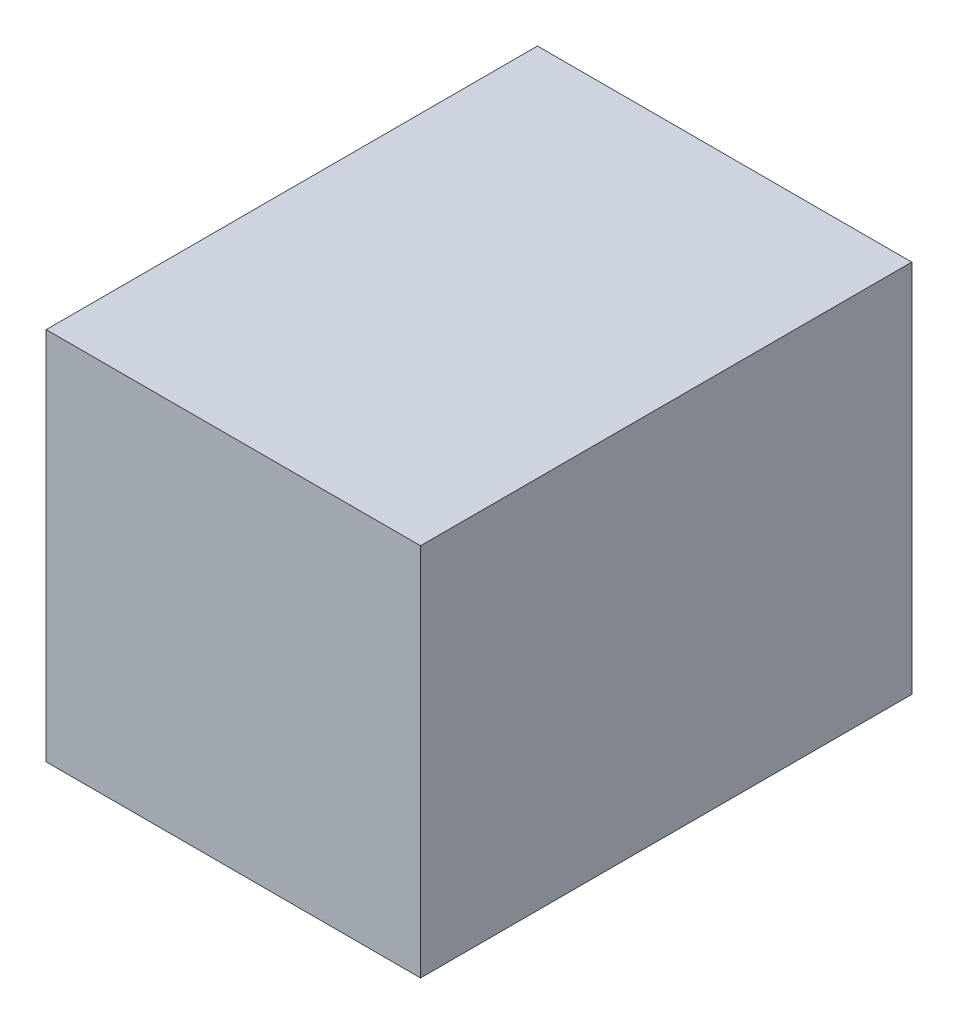
ISO-10303-21;
HEADER;
FILE_DESCRIPTION(('STEP AP214'),'2;1');
FILE_NAME('part.step','',(''),(''),'','','');
FILE_SCHEMA(('AUTOMOTIVE_DESIGN { 1 0 10303 214 1 1 1 1 }'));
ENDSEC;
DATA;
#1=APPLICATION_CONTEXT('core data for automotive mechanical design processes');
#2=APPLICATION_PROTOCOL_DEFINITION('international standard','automotive_design',2000,#1);
#3=PRODUCT_CONTEXT('',#1,'mechanical');
#4=PRODUCT('Part','Part','',(#3));
#5=PRODUCT_RELATED_PRODUCT_CATEGORY('part','',(#4));
#6=PRODUCT_DEFINITION_FORMATION('','',#4);
#7=PRODUCT_DEFINITION_CONTEXT('part definition',#1,'design');
#8=PRODUCT_DEFINITION('design','',#6,#7);
#9=PRODUCT_DEFINITION_SHAPE('','',#8);
#10=(LENGTH_UNIT() NAMED_UNIT(*) SI_UNIT(.MILLI.,.METRE.));
#11=(NAMED_UNIT(*) PLANE_ANGLE_UNIT() SI_UNIT($,.RADIAN.));
#12=(NAMED_UNIT(*) SI_UNIT($,.STERADIAN.) SOLID_ANGLE_UNIT());
#13=UNCERTAINTY_MEASURE_WITH_UNIT(LENGTH_MEASURE(1.E-05),#10,'distance_accuracy_value','');
#14=(GEOMETRIC_REPRESENTATION_CONTEXT(3) GLOBAL_UNCERTAINTY_ASSIGNED_CONTEXT((#13)) GLOBAL_UNIT_ASSIGNED_CONTEXT((#10,
#11,#12)) REPRESENTATION_CONTEXT('',''));
#15=CARTESIAN_POINT('',(0.,0.,0.));
#16=DIRECTION('',(0.,0.,1.));
#17=DIRECTION('',(1.,0.,0.));
#18=AXIS2_PLACEMENT_3D('',#15,#16,#17);
#19=CARTESIAN_POINT('',(381.,-381.,1000.));
#20=DIRECTION('',(-1.,0.,0.));
#21=DIRECTION('',(0.,0.,1.));
#22=AXIS2_PLACEMENT_3D('',#19,#20,#21);
#23=PLANE('',#22);
#24=DIRECTION('',(0.,1.,0.));
#25=VECTOR('',#24,1.);
#26=CARTESIAN_POINT('',(381.,-381.,0.));
#27=LINE('',#26,#25);
#28=CARTESIAN_POINT('',(381.,-381.,0.));
#29=VERTEX_POINT('',#28);
#30=CARTESIAN_POINT('',(381.,381.,0.));
#31=VERTEX_POINT('',#30);
#32=EDGE_CURVE('E96',#29,#31,#27,.T.);
#33=ORIENTED_EDGE('',*,*,#32,.T.);
#34=DIRECTION('',(0.,0.,-1.));
#35=VECTOR('',#34,1.);
#36=CARTESIAN_POINT('',(381.,381.,1000.));
#37=LINE('',#36,#35);
#38=CARTESIAN_POINT('',(381.,381.,1000.));
#39=VERTEX_POINT('',#38);
#40=EDGE_CURVE('E11',#39,#31,#37,.T.);
#41=ORIENTED_EDGE('',*,*,#40,.F.);
#42=DIRECTION('',(0.,1.,0.));
#43=VECTOR('',#42,1.);
#44=CARTESIAN_POINT('',(381.,-381.,1000.));
#45=LINE('',#44,#43);
#46=CARTESIAN_POINT('',(381.,-381.,1000.));
#47=VERTEX_POINT('',#46);
#48=EDGE_CURVE('E84',#47,#39,#45,.T.);
#49=ORIENTED_EDGE('',*,*,#48,.F.);
#50=DIRECTION('',(0.,0.,-1.));
#51=VECTOR('',#50,1.);
#52=CARTESIAN_POINT('',(381.,-381.,1000.));
#53=LINE('',#52,#51);
#54=EDGE_CURVE('E92',#47,#29,#53,.T.);
#55=ORIENTED_EDGE('',*,*,#54,.T.);
#56=EDGE_LOOP('',(#33,#41,#49,#55));
#57=FACE_BOUND('',#56,.T.);
#58=ADVANCED_FACE('F33',(#57),#23,.F.);
#59=CARTESIAN_POINT('',(-381.,381.,1000.));
#60=DIRECTION('',(0.,-1.,0.));
#61=DIRECTION('',(0.,0.,-1.));
#62=AXIS2_PLACEMENT_3D('',#59,#60,#61);
#63=PLANE('',#62);
#64=DIRECTION('',(-1.,0.,0.));
#65=VECTOR('',#64,1.);
#66=CARTESIAN_POINT('',(-381.,381.,0.));
#67=LINE('',#66,#65);
#68=CARTESIAN_POINT('',(-381.,381.,0.));
#69=VERTEX_POINT('',#68);
#70=EDGE_CURVE('E88',#31,#69,#67,.T.);
#71=ORIENTED_EDGE('',*,*,#70,.T.);
#72=DIRECTION('',(0.,0.,-1.));
#73=VECTOR('',#72,1.);
#74=CARTESIAN_POINT('',(-381.,381.,1000.));
#75=LINE('',#74,#73);
#76=CARTESIAN_POINT('',(-381.,381.,1000.));
#77=VERTEX_POINT('',#76);
#78=EDGE_CURVE('E41',#77,#69,#75,.T.);
#79=ORIENTED_EDGE('',*,*,#78,.F.);
#80=DIRECTION('',(-1.,0.,0.));
#81=VECTOR('',#80,1.);
#82=CARTESIAN_POINT('',(-381.,381.,1000.));
#83=LINE('',#82,#81);
#84=EDGE_CURVE('E79',#39,#77,#83,.T.);
#85=ORIENTED_EDGE('',*,*,#84,.F.);
#86=ORIENTED_EDGE('',*,*,#40,.T.);
#87=EDGE_LOOP('',(#71,#79,#85,#86));
#88=FACE_BOUND('',#87,.T.);
#89=ADVANCED_FACE('F87',(#88),#63,.F.);
#90=CARTESIAN_POINT('',(-381.,-381.,1000.));
#91=DIRECTION('',(1.,0.,0.));
#92=DIRECTION('',(0.,0.,-1.));
#93=AXIS2_PLACEMENT_3D('',#90,#91,#92);
#94=PLANE('',#93);
#95=DIRECTION('',(0.,-1.,0.));
#96=VECTOR('',#95,1.);
#97=CARTESIAN_POINT('',(-381.,-381.,0.));
#98=LINE('',#97,#96);
#99=CARTESIAN_POINT('',(-381.,-381.,0.));
#100=VERTEX_POINT('',#99);
#101=EDGE_CURVE('E66',#69,#100,#98,.T.);
#102=ORIENTED_EDGE('',*,*,#101,.T.);
#103=DIRECTION('',(0.,0.,-1.));
#104=VECTOR('',#103,1.);
#105=CARTESIAN_POINT('',(-381.,-381.,1000.));
#106=LINE('',#105,#104);
#107=CARTESIAN_POINT('',(-381.,-381.,1000.));
#108=VERTEX_POINT('',#107);
#109=EDGE_CURVE('E89',#108,#100,#106,.T.);
#110=ORIENTED_EDGE('',*,*,#109,.F.);
#111=DIRECTION('',(0.,-1.,0.));
#112=VECTOR('',#111,1.);
#113=CARTESIAN_POINT('',(-381.,-381.,1000.));
#114=LINE('',#113,#112);
#115=EDGE_CURVE('E82',#77,#108,#114,.T.);
#116=ORIENTED_EDGE('',*,*,#115,.F.);
#117=ORIENTED_EDGE('',*,*,#78,.T.);
#118=EDGE_LOOP('',(#102,#110,#116,#117));
#119=FACE_BOUND('',#118,.T.);
#120=ADVANCED_FACE('F90',(#119),#94,.F.);
#121=CARTESIAN_POINT('',(-381.,-381.,1000.));
#122=DIRECTION('',(0.,1.,0.));
#123=DIRECTION('',(0.,0.,1.));
#124=AXIS2_PLACEMENT_3D('',#121,#122,#123);
#125=PLANE('',#124);
#126=DIRECTION('',(1.,0.,0.));
#127=VECTOR('',#126,1.);
#128=CARTESIAN_POINT('',(-381.,-381.,0.));
#129=LINE('',#128,#127);
#130=EDGE_CURVE('E72',#100,#29,#129,.T.);
#131=ORIENTED_EDGE('',*,*,#130,.T.);
#132=ORIENTED_EDGE('',*,*,#54,.F.);
#133=DIRECTION('',(1.,0.,0.));
#134=VECTOR('',#133,1.);
#135=CARTESIAN_POINT('',(-381.,-381.,1000.));
#136=LINE('',#135,#134);
#137=EDGE_CURVE('E49',#108,#47,#136,.T.);
#138=ORIENTED_EDGE('',*,*,#137,.F.);
#139=ORIENTED_EDGE('',*,*,#109,.T.);
#140=EDGE_LOOP('',(#131,#132,#138,#139));
#141=FACE_BOUND('',#140,.T.);
#142=ADVANCED_FACE('F103',(#141),#125,.F.);
#143=CARTESIAN_POINT('',(0.,0.,1000.));
#144=DIRECTION('',(0.,0.,-1.));
#145=DIRECTION('',(-1.,0.,0.));
#146=AXIS2_PLACEMENT_3D('',#143,#144,#145);
#147=PLANE('',#146);
#148=ORIENTED_EDGE('',*,*,#48,.T.);
#149=ORIENTED_EDGE('',*,*,#84,.T.);
#150=ORIENTED_EDGE('',*,*,#115,.T.);
#151=ORIENTED_EDGE('',*,*,#137,.T.);
#152=EDGE_LOOP('',(#148,#149,#150,#151));
#153=FACE_BOUND('',#152,.T.);
#154=ADVANCED_FACE('F80',(#153),#147,.F.);
#155=CARTESIAN_POINT('',(0.,0.,0.));
#156=DIRECTION('',(0.,0.,-1.));
#157=DIRECTION('',(-1.,0.,0.));
#158=AXIS2_PLACEMENT_3D('',#155,#156,#157);
#159=PLANE('',#158);
#160=ORIENTED_EDGE('',*,*,#32,.F.);
#161=ORIENTED_EDGE('',*,*,#130,.F.);
#162=ORIENTED_EDGE('',*,*,#101,.F.);
#163=ORIENTED_EDGE('',*,*,#70,.F.);
#164=EDGE_LOOP('',(#160,#161,#162,#163));
#165=FACE_BOUND('',#164,.T.);
#166=ADVANCED_FACE('F106',(#165),#159,.T.);
#167=CLOSED_SHELL('',(#58,#89,#120,#142,#154,#166));
#168=MANIFOLD_SOLID_BREP('B2',#167);
#169=ADVANCED_BREP_SHAPE_REPRESENTATION('',(#18,#168),#14);
#170=SHAPE_DEFINITION_REPRESENTATION(#9,#169);
ENDSEC;
END-ISO-10303-21;
